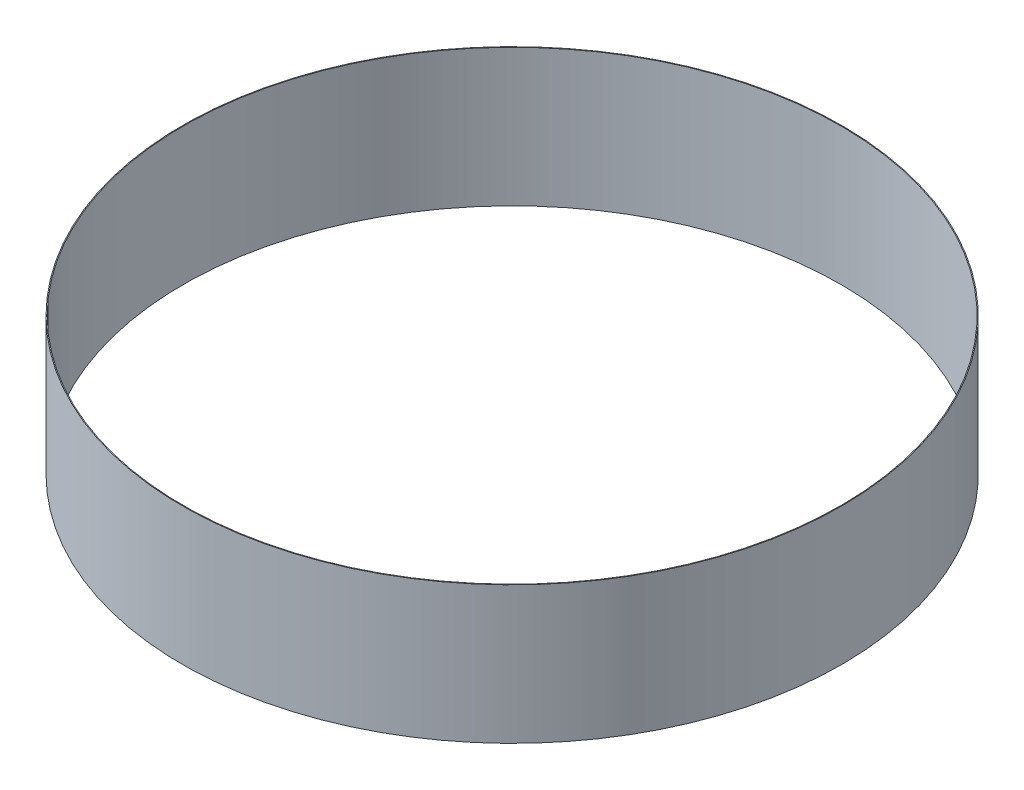
ISO-10303-21;
HEADER;
FILE_DESCRIPTION(('STEP AP214'),'2;1');
FILE_NAME('part.step','',(''),(''),'','','');
FILE_SCHEMA(('AUTOMOTIVE_DESIGN { 1 0 10303 214 1 1 1 1 }'));
ENDSEC;
DATA;
#1=APPLICATION_CONTEXT('core data for automotive mechanical design processes');
#2=APPLICATION_PROTOCOL_DEFINITION('international standard','automotive_design',2000,#1);
#3=PRODUCT_CONTEXT('',#1,'mechanical');
#4=PRODUCT('Part','Part','',(#3));
#5=PRODUCT_RELATED_PRODUCT_CATEGORY('part','',(#4));
#6=PRODUCT_DEFINITION_FORMATION('','',#4);
#7=PRODUCT_DEFINITION_CONTEXT('part definition',#1,'design');
#8=PRODUCT_DEFINITION('design','',#6,#7);
#9=PRODUCT_DEFINITION_SHAPE('','',#8);
#10=(LENGTH_UNIT() NAMED_UNIT(*) SI_UNIT(.MILLI.,.METRE.));
#11=(NAMED_UNIT(*) PLANE_ANGLE_UNIT() SI_UNIT($,.RADIAN.));
#12=(NAMED_UNIT(*) SI_UNIT($,.STERADIAN.) SOLID_ANGLE_UNIT());
#13=UNCERTAINTY_MEASURE_WITH_UNIT(LENGTH_MEASURE(1.E-05),#10,'distance_accuracy_value','');
#14=(GEOMETRIC_REPRESENTATION_CONTEXT(3) GLOBAL_UNCERTAINTY_ASSIGNED_CONTEXT((#13)) GLOBAL_UNIT_ASSIGNED_CONTEXT((#10,
#11,#12)) REPRESENTATION_CONTEXT('',''));
#15=CARTESIAN_POINT('',(0.,0.,0.));
#16=DIRECTION('',(0.,0.,1.));
#17=DIRECTION('',(1.,0.,0.));
#18=AXIS2_PLACEMENT_3D('',#15,#16,#17);
#19=CARTESIAN_POINT('',(0.,1000.,0.));
#20=DIRECTION('',(0.,-1.,0.));
#21=DIRECTION('',(0.,0.,-1.));
#22=AXIS2_PLACEMENT_3D('',#19,#20,#21);
#23=CYLINDRICAL_SURFACE('',#22,4788.);
#24=CARTESIAN_POINT('',(0.,-1000.,0.));
#25=DIRECTION('',(0.,1.,0.));
#26=DIRECTION('',(1.,0.,0.));
#27=AXIS2_PLACEMENT_3D('',#24,#25,#26);
#28=CIRCLE('',#27,4788.);
#29=CARTESIAN_POINT('',(-3385.92270714466,-1000.,3385.3318037147));
#30=VERTEX_POINT('',#29);
#31=CARTESIAN_POINT('',(-3385.33180371466,-1000.,3385.92270714469));
#32=VERTEX_POINT('',#31);
#33=EDGE_CURVE('E101',#30,#32,#28,.F.);
#34=ORIENTED_EDGE('',*,*,#33,.T.);
#35=DIRECTION('',(0.,-1.,0.));
#36=VECTOR('',#35,1.);
#37=CARTESIAN_POINT('',(-3385.33180371466,1000.,3385.92270714469));
#38=LINE('',#37,#36);
#39=CARTESIAN_POINT('',(-3385.33180371466,1000.,3385.92270714469));
#40=VERTEX_POINT('',#39);
#41=EDGE_CURVE('E11',#40,#32,#38,.T.);
#42=ORIENTED_EDGE('',*,*,#41,.F.);
#43=CARTESIAN_POINT('',(0.,1000.,0.));
#44=DIRECTION('',(0.,1.,0.));
#45=DIRECTION('',(1.,0.,0.));
#46=AXIS2_PLACEMENT_3D('',#43,#44,#45);
#47=CIRCLE('',#46,4788.);
#48=CARTESIAN_POINT('',(-3385.92270714466,1000.,3385.3318037147));
#49=VERTEX_POINT('',#48);
#50=EDGE_CURVE('E78',#49,#40,#47,.F.);
#51=ORIENTED_EDGE('',*,*,#50,.F.);
#52=DIRECTION('',(0.,-1.,0.));
#53=VECTOR('',#52,1.);
#54=CARTESIAN_POINT('',(-3385.92270714466,1000.,3385.3318037147));
#55=LINE('',#54,#53);
#56=EDGE_CURVE('E54',#49,#30,#55,.T.);
#57=ORIENTED_EDGE('',*,*,#56,.T.);
#58=EDGE_LOOP('',(#34,#42,#51,#57));
#59=FACE_BOUND('',#58,.T.);
#60=ADVANCED_FACE('F38',(#59),#23,.F.);
#61=CARTESIAN_POINT('',(-3393.8163445761,1000.,3394.40872896711));
#62=DIRECTION('',(-0.707168485201551,0.,-0.707045071786619));
#63=DIRECTION('',(-0.707045071786619,0.,0.707168485201551));
#64=AXIS2_PLACEMENT_3D('',#61,#62,#63);
#65=PLANE('',#64);
#66=DIRECTION('',(0.707045071786618,0.,-0.70716848520155));
#67=VECTOR('',#66,1.);
#68=CARTESIAN_POINT('',(-3393.8163445761,-1000.,3394.40872896711));
#69=LINE('',#68,#67);
#70=CARTESIAN_POINT('',(-3393.8163445761,-1000.,3394.40872896711));
#71=VERTEX_POINT('',#70);
#72=EDGE_CURVE('E87',#71,#32,#69,.T.);
#73=ORIENTED_EDGE('',*,*,#72,.F.);
#74=DIRECTION('',(0.,-1.,0.));
#75=VECTOR('',#74,1.);
#76=CARTESIAN_POINT('',(-3393.8163445761,1000.,3394.40872896711));
#77=LINE('',#76,#75);
#78=CARTESIAN_POINT('',(-3393.8163445761,1000.,3394.40872896711));
#79=VERTEX_POINT('',#78);
#80=EDGE_CURVE('E46',#79,#71,#77,.T.);
#81=ORIENTED_EDGE('',*,*,#80,.F.);
#82=DIRECTION('',(0.707045071786618,0.,-0.70716848520155));
#83=VECTOR('',#82,1.);
#84=CARTESIAN_POINT('',(-3393.8163445761,1000.,3394.40872896711));
#85=LINE('',#84,#83);
#86=EDGE_CURVE('E85',#79,#40,#85,.T.);
#87=ORIENTED_EDGE('',*,*,#86,.T.);
#88=ORIENTED_EDGE('',*,*,#41,.T.);
#89=EDGE_LOOP('',(#73,#81,#87,#88));
#90=FACE_BOUND('',#89,.T.);
#91=ADVANCED_FACE('F84',(#90),#65,.T.);
#92=CARTESIAN_POINT('',(0.,1000.,0.));
#93=DIRECTION('',(0.,-1.,0.));
#94=DIRECTION('',(0.,0.,-1.));
#95=AXIS2_PLACEMENT_3D('',#92,#93,#94);
#96=CYLINDRICAL_SURFACE('',#95,4800.);
#97=CARTESIAN_POINT('',(0.,-1000.,0.));
#98=DIRECTION('',(0.,-1.,0.));
#99=DIRECTION('',(0.,0.,-1.));
#100=AXIS2_PLACEMENT_3D('',#97,#98,#99);
#101=CIRCLE('',#100,4800.);
#102=CARTESIAN_POINT('',(-3394.40872896707,-1000.,3393.81634457614));
#103=VERTEX_POINT('',#102);
#104=EDGE_CURVE('E104',#103,#71,#101,.T.);
#105=ORIENTED_EDGE('',*,*,#104,.F.);
#106=DIRECTION('',(0.,-1.,0.));
#107=VECTOR('',#106,1.);
#108=CARTESIAN_POINT('',(-3394.40872896707,1000.,3393.81634457614));
#109=LINE('',#108,#107);
#110=CARTESIAN_POINT('',(-3394.40872896707,1000.,3393.81634457614));
#111=VERTEX_POINT('',#110);
#112=EDGE_CURVE('E67',#111,#103,#109,.T.);
#113=ORIENTED_EDGE('',*,*,#112,.F.);
#114=CARTESIAN_POINT('',(0.,1000.,0.));
#115=DIRECTION('',(0.,-1.,0.));
#116=DIRECTION('',(0.,0.,-1.));
#117=AXIS2_PLACEMENT_3D('',#114,#115,#116);
#118=CIRCLE('',#117,4800.);
#119=EDGE_CURVE('E93',#111,#79,#118,.T.);
#120=ORIENTED_EDGE('',*,*,#119,.T.);
#121=ORIENTED_EDGE('',*,*,#80,.T.);
#122=EDGE_LOOP('',(#105,#113,#120,#121));
#123=FACE_BOUND('',#122,.T.);
#124=ADVANCED_FACE('F95',(#123),#96,.T.);
#125=CARTESIAN_POINT('',(-3385.92270714466,1000.,3385.3318037147));
#126=DIRECTION('',(0.707045071786785,0.,0.707168485201384));
#127=DIRECTION('',(0.707168485201384,0.,-0.707045071786785));
#128=AXIS2_PLACEMENT_3D('',#125,#126,#127);
#129=PLANE('',#128);
#130=DIRECTION('',(-0.707168485201384,0.,0.707045071786785));
#131=VECTOR('',#130,1.);
#132=CARTESIAN_POINT('',(-3385.92270714466,-1000.,3385.3318037147));
#133=LINE('',#132,#131);
#134=EDGE_CURVE('E106',#30,#103,#133,.T.);
#135=ORIENTED_EDGE('',*,*,#134,.F.);
#136=ORIENTED_EDGE('',*,*,#56,.F.);
#137=DIRECTION('',(-0.707168485201384,0.,0.707045071786785));
#138=VECTOR('',#137,1.);
#139=CARTESIAN_POINT('',(-3385.92270714466,1000.,3385.3318037147));
#140=LINE('',#139,#138);
#141=EDGE_CURVE('E96',#49,#111,#140,.T.);
#142=ORIENTED_EDGE('',*,*,#141,.T.);
#143=ORIENTED_EDGE('',*,*,#112,.T.);
#144=EDGE_LOOP('',(#135,#136,#142,#143));
#145=FACE_BOUND('',#144,.T.);
#146=ADVANCED_FACE('F112',(#145),#129,.T.);
#147=CARTESIAN_POINT('',(0.,1000.,0.));
#148=DIRECTION('',(0.,1.,0.));
#149=DIRECTION('',(1.,0.,0.));
#150=AXIS2_PLACEMENT_3D('',#147,#148,#149);
#151=PLANE('',#150);
#152=ORIENTED_EDGE('',*,*,#50,.T.);
#153=ORIENTED_EDGE('',*,*,#86,.F.);
#154=ORIENTED_EDGE('',*,*,#119,.F.);
#155=ORIENTED_EDGE('',*,*,#141,.F.);
#156=EDGE_LOOP('',(#152,#153,#154,#155));
#157=FACE_BOUND('',#156,.T.);
#158=ADVANCED_FACE('F92',(#157),#151,.T.);
#159=CARTESIAN_POINT('',(0.,-1000.,0.));
#160=DIRECTION('',(0.,1.,0.));
#161=DIRECTION('',(1.,0.,0.));
#162=AXIS2_PLACEMENT_3D('',#159,#160,#161);
#163=PLANE('',#162);
#164=ORIENTED_EDGE('',*,*,#33,.F.);
#165=ORIENTED_EDGE('',*,*,#134,.T.);
#166=ORIENTED_EDGE('',*,*,#104,.T.);
#167=ORIENTED_EDGE('',*,*,#72,.T.);
#168=EDGE_LOOP('',(#164,#165,#166,#167));
#169=FACE_BOUND('',#168,.T.);
#170=ADVANCED_FACE('F111',(#169),#163,.F.);
#171=CLOSED_SHELL('',(#60,#91,#124,#146,#158,#170));
#172=MANIFOLD_SOLID_BREP('B2',#171);
#173=ADVANCED_BREP_SHAPE_REPRESENTATION('',(#18,#172),#14);
#174=SHAPE_DEFINITION_REPRESENTATION(#9,#173);
ENDSEC;
END-ISO-10303-21;
